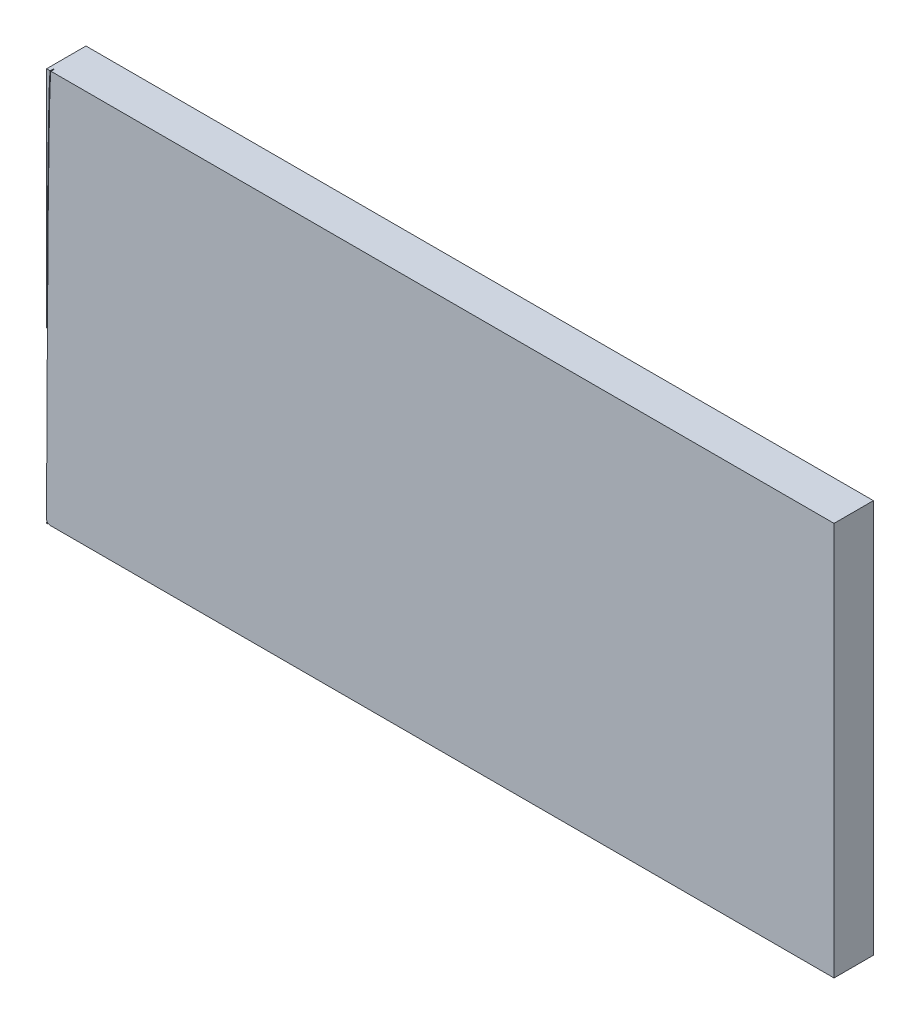
ISO-10303-21;
HEADER;
FILE_DESCRIPTION(('STEP AP214'),'2;1');
FILE_NAME('part.step','',(''),(''),'','','');
FILE_SCHEMA(('AUTOMOTIVE_DESIGN { 1 0 10303 214 1 1 1 1 }'));
ENDSEC;
DATA;
#1=APPLICATION_CONTEXT('core data for automotive mechanical design processes');
#2=APPLICATION_PROTOCOL_DEFINITION('international standard','automotive_design',2000,#1);
#3=PRODUCT_CONTEXT('',#1,'mechanical');
#4=PRODUCT('Part','Part','',(#3));
#5=PRODUCT_RELATED_PRODUCT_CATEGORY('part','',(#4));
#6=PRODUCT_DEFINITION_FORMATION('','',#4);
#7=PRODUCT_DEFINITION_CONTEXT('part definition',#1,'design');
#8=PRODUCT_DEFINITION('design','',#6,#7);
#9=PRODUCT_DEFINITION_SHAPE('','',#8);
#10=(LENGTH_UNIT() NAMED_UNIT(*) SI_UNIT(.MILLI.,.METRE.));
#11=(NAMED_UNIT(*) PLANE_ANGLE_UNIT() SI_UNIT($,.RADIAN.));
#12=(NAMED_UNIT(*) SI_UNIT($,.STERADIAN.) SOLID_ANGLE_UNIT());
#13=UNCERTAINTY_MEASURE_WITH_UNIT(LENGTH_MEASURE(1.E-05),#10,'distance_accuracy_value','');
#14=(GEOMETRIC_REPRESENTATION_CONTEXT(3) GLOBAL_UNCERTAINTY_ASSIGNED_CONTEXT((#13)) GLOBAL_UNIT_ASSIGNED_CONTEXT((#10,
#11,#12)) REPRESENTATION_CONTEXT('',''));
#15=CARTESIAN_POINT('',(0.,0.,0.));
#16=DIRECTION('',(0.,0.,1.));
#17=DIRECTION('',(1.,0.,0.));
#18=AXIS2_PLACEMENT_3D('',#15,#16,#17);
#19=CARTESIAN_POINT('',(0.,0.,127.));
#20=DIRECTION('',(0.,0.,-1.));
#21=DIRECTION('',(-1.,0.,0.));
#22=AXIS2_PLACEMENT_3D('',#19,#20,#21);
#23=PLANE('',#22);
#24=CARTESIAN_POINT('',(-42.3012850712292,1243.87428571429,127.));
#25=CARTESIAN_POINT('',(-52.1155044659749,1243.73864680293,127.));
#26=CARTESIAN_POINT('',(-56.7848594057362,34.9749192073273,127.));
#27=CARTESIAN_POINT('',(-56.6057142857144,22.6324198520287,127.));
#28=B_SPLINE_CURVE_WITH_KNOTS('',3,(#24,#25,#26,#27),.UNSPECIFIED.,.F.,.F.,(4,4),(0.,1.),.UNSPECIFIED.);
#29=CARTESIAN_POINT('',(-42.3012850712292,1243.87428571429,127.));
#30=VERTEX_POINT('',#29);
#31=CARTESIAN_POINT('',(-56.6057142857143,28.7711471672931,127.));
#32=VERTEX_POINT('',#31);
#33=EDGE_CURVE('E135',#30,#32,#28,.T.);
#34=ORIENTED_EDGE('',*,*,#33,.T.);
#35=DIRECTION('',(0.,-1.,0.));
#36=VECTOR('',#35,1.);
#37=CARTESIAN_POINT('',(-56.6057142857144,1243.87428571429,127.));
#38=LINE('',#37,#36);
#39=CARTESIAN_POINT('',(-56.6057142857144,-12.2982642373145,127.));
#40=VERTEX_POINT('',#39);
#41=EDGE_CURVE('E203',#32,#40,#38,.T.);
#42=ORIENTED_EDGE('',*,*,#41,.T.);
#43=CARTESIAN_POINT('',(-56.6057142857144,-12.2982642373145,127.));
#44=CARTESIAN_POINT('',(-56.5727621871857,-21.1376170869562,127.));
#45=CARTESIAN_POINT('',(-53.0456704938453,-25.9866982400848,127.));
#46=CARTESIAN_POINT('',(-42.3012850712292,-26.1257142857143,127.));
#47=B_SPLINE_CURVE_WITH_KNOTS('',3,(#43,#44,#45,#46),.UNSPECIFIED.,.F.,.F.,(4,4),(0.,1.),.UNSPECIFIED.);
#48=CARTESIAN_POINT('',(-42.3012850712292,-26.1257142857143,127.));
#49=VERTEX_POINT('',#48);
#50=EDGE_CURVE('E264',#40,#49,#47,.T.);
#51=ORIENTED_EDGE('',*,*,#50,.T.);
#52=DIRECTION('',(1.,0.,0.));
#53=VECTOR('',#52,1.);
#54=CARTESIAN_POINT('',(-56.6057142857143,-26.1257142857143,127.));
#55=LINE('',#54,#53);
#56=CARTESIAN_POINT('',(2483.39428571429,-26.1257142857143,127.));
#57=VERTEX_POINT('',#56);
#58=EDGE_CURVE('E220',#49,#57,#55,.T.);
#59=ORIENTED_EDGE('',*,*,#58,.T.);
#60=DIRECTION('',(0.,-1.,0.));
#61=VECTOR('',#60,1.);
#62=CARTESIAN_POINT('',(2483.39428571429,1243.87428571429,127.));
#63=LINE('',#62,#61);
#64=CARTESIAN_POINT('',(2483.39428571429,1243.87428571429,127.));
#65=VERTEX_POINT('',#64);
#66=EDGE_CURVE('E205',#65,#57,#63,.T.);
#67=ORIENTED_EDGE('',*,*,#66,.F.);
#68=DIRECTION('',(1.,0.,0.));
#69=VECTOR('',#68,1.);
#70=CARTESIAN_POINT('',(-56.6057142857144,1243.87428571429,127.));
#71=LINE('',#70,#69);
#72=EDGE_CURVE('E199',#30,#65,#71,.T.);
#73=ORIENTED_EDGE('',*,*,#72,.F.);
#74=EDGE_LOOP('',(#34,#42,#51,#59,#67,#73));
#75=FACE_BOUND('',#74,.T.);
#76=ADVANCED_FACE('F39',(#75),#23,.F.);
#77=CARTESIAN_POINT('',(-56.6057142857144,1243.87428571429,127.));
#78=VERTEX_POINT('',#77);
#79=CARTESIAN_POINT('',(-56.6057142858211,519.524275061396,127.));
#80=VERTEX_POINT('',#79);
#81=EDGE_CURVE('E191',#78,#80,#38,.T.);
#82=ORIENTED_EDGE('',*,*,#81,.T.);
#83=CARTESIAN_POINT('',(-42.3363861752485,1246.41404316579,127.));
#84=CARTESIAN_POINT('',(-42.5495716758496,1246.41109680317,127.));
#85=CARTESIAN_POINT('',(-42.7612244182873,1246.38163542832,127.));
#86=CARTESIAN_POINT('',(-43.1511692690802,1246.28244276995,127.));
#87=CARTESIAN_POINT('',(-43.3292561058576,1246.21341021825,127.));
#88=CARTESIAN_POINT('',(-43.641664424916,1246.05878160045,127.));
#89=CARTESIAN_POINT('',(-43.7763924169793,1245.9734834972,127.));
#90=CARTESIAN_POINT('',(-44.0084851603743,1245.80276473524,127.));
#91=CARTESIAN_POINT('',(-44.1061481374805,1245.7172621697,127.));
#92=CARTESIAN_POINT('',(-44.3587428844354,1245.47068072945,127.));
#93=CARTESIAN_POINT('',(-44.4748627545593,1245.32021273476,127.));
#94=CARTESIAN_POINT('',(-44.6605648666339,1245.0495459359,127.));
#95=CARTESIAN_POINT('',(-44.7295500162383,1244.92818696503,127.));
#96=CARTESIAN_POINT('',(-44.9043623013462,1244.5892308458,127.));
#97=CARTESIAN_POINT('',(-44.9795671924874,1244.39465095095,127.));
#98=CARTESIAN_POINT('',(-45.111700992093,1244.0111778793,127.));
#99=CARTESIAN_POINT('',(-45.1660897062559,1243.82331283963,127.));
#100=CARTESIAN_POINT('',(-45.3176692194605,1243.23734399333,127.));
#101=CARTESIAN_POINT('',(-45.4030426685015,1242.81584899436,127.));
#102=CARTESIAN_POINT('',(-45.5686949333253,1241.85602983432,127.));
#103=CARTESIAN_POINT('',(-45.6476587854724,1241.31976230487,127.));
#104=CARTESIAN_POINT('',(-45.8805299854355,1239.5210006222,127.));
#105=CARTESIAN_POINT('',(-46.0302217724448,1238.06836089664,127.));
#106=CARTESIAN_POINT('',(-46.3260253874934,1234.64012832316,127.));
#107=CARTESIAN_POINT('',(-46.4717375418899,1232.66591596795,127.));
#108=CARTESIAN_POINT('',(-46.9043342671375,1225.97720903699,127.));
#109=CARTESIAN_POINT('',(-47.1866179394066,1220.49661803958,127.));
#110=CARTESIAN_POINT('',(-47.7409264891347,1207.62131086472,127.));
#111=CARTESIAN_POINT('',(-48.0128461971767,1200.22733806259,127.));
#112=CARTESIAN_POINT('',(-49.3471760321734,1158.83150693979,127.));
#113=CARTESIAN_POINT('',(-50.3339448511548,1111.54793679969,127.));
#114=CARTESIAN_POINT('',(-53.0568913673371,941.226989355821,127.));
#115=CARTESIAN_POINT('',(-54.5550449936448,789.729621862863,127.));
#116=CARTESIAN_POINT('',(-56.9268229007956,485.971893095493,127.));
#117=CARTESIAN_POINT('',(-57.8004020015175,333.713089740301,127.));
#118=CARTESIAN_POINT('',(-58.6492759233292,161.121262599132,127.));
#119=CARTESIAN_POINT('',(-58.8553175075413,112.890130191541,127.));
#120=CARTESIAN_POINT('',(-59.0498760445666,61.5379801509372,127.));
#121=CARTESIAN_POINT('',(-59.0956448220798,47.9197759443375,127.));
#122=CARTESIAN_POINT('',(-59.1357825002151,33.6208510738069,127.));
#123=CARTESIAN_POINT('',(-59.144409355143,29.876068043908,127.));
#124=CARTESIAN_POINT('',(-59.1502344942744,25.8994568556923,127.));
#125=CARTESIAN_POINT('',(-59.1509912774685,24.8474905510731,127.));
#126=CARTESIAN_POINT('',(-59.1503429150153,23.6912458534018,127.));
#127=CARTESIAN_POINT('',(-59.149831021123,23.3762134547188,127.));
#128=CARTESIAN_POINT('',(-59.1486007637388,23.0085760561042,127.));
#129=CARTESIAN_POINT('',(-59.14811452718,22.903540891139,127.));
#130=CARTESIAN_POINT('',(-59.1469607259598,22.7266841978005,127.));
#131=CARTESIAN_POINT('',(-59.1463193008106,22.6556709324713,127.));
#132=CARTESIAN_POINT('',(-59.1454467764384,22.5955569226676,127.));
#133=B_SPLINE_CURVE_WITH_KNOTS('',3,(#83,#84,#85,#86,#87,#88,#89,#90,#91,#92,#93,#94,#95,#96,
#97,#98,#99,#100,#101,#102,#103,#104,#105,#106,#107,#108,#109,#110,#111,#112,#113,#114,#115,
#116,#117,#118,#119,#120,#121,#122,#123,#124,#125,#126,#127,#128,#129,#130,#131,#132),
.UNSPECIFIED.,.F.,.F.,(4,2,2,2,2,2,2,2,2,2,2,2,2,2,2,2,2,2,2,2,2,2,2,2,4),(0.,
0.000976562499999343,0.00195312499999869,0.00292968749999803,0.00390624999999737,
0.00585937499999735,0.00781249999999732,0.0117187499999973,0.0156249999999973,
0.0234374999999973,0.0312499999999974,0.0468749999999974,0.0624999999999974,0.0937499999999975,
0.124999999999998,0.249999999999998,0.499999999999998,0.749999999999999,0.875,0.9375,0.96875,
0.984375,0.9921875,0.99609375,1.),.UNSPECIFIED.);
#134=CARTESIAN_POINT('',(-45.1493775916594,1243.87428572405,127.));
#135=VERTEX_POINT('',#134);
#136=EDGE_CURVE('E184',#80,#135,#133,.F.);
#137=ORIENTED_EDGE('',*,*,#136,.T.);
#138=EDGE_CURVE('E189',#78,#135,#71,.T.);
#139=ORIENTED_EDGE('',*,*,#138,.F.);
#140=EDGE_LOOP('',(#82,#137,#139));
#141=FACE_BOUND('',#140,.T.);
#142=ADVANCED_FACE('F188',(#141),#23,.F.);
#143=CARTESIAN_POINT('',(-56.6057142857143,-26.1257142857143,127.));
#144=DIRECTION('',(0.,1.,0.));
#145=DIRECTION('',(0.,0.,1.));
#146=AXIS2_PLACEMENT_3D('',#143,#144,#145);
#147=PLANE('',#146);
#148=DIRECTION('',(-1.,0.,0.));
#149=VECTOR('',#148,1.);
#150=CARTESIAN_POINT('',(-56.6057142857143,-26.1257142857143,116.84));
#151=LINE('',#150,#149);
#152=CARTESIAN_POINT('',(-42.3012850712292,-26.1257142857143,116.84));
#153=VERTEX_POINT('',#152);
#154=CARTESIAN_POINT('',(-52.96506687173,-26.1257142954648,116.84));
#155=VERTEX_POINT('',#154);
#156=EDGE_CURVE('E156',#153,#155,#151,.T.);
#157=ORIENTED_EDGE('',*,*,#156,.T.);
#158=DIRECTION('',(0.,0.,1.));
#159=VECTOR('',#158,1.);
#160=CARTESIAN_POINT('',(-52.9650668873842,-26.1257142857143,116.84));
#161=LINE('',#160,#159);
#162=CARTESIAN_POINT('',(-52.96506687173,-26.1257142954648,127.));
#163=VERTEX_POINT('',#162);
#164=EDGE_CURVE('E171',#155,#163,#161,.T.);
#165=ORIENTED_EDGE('',*,*,#164,.T.);
#166=CARTESIAN_POINT('',(-56.6057142857143,-26.1257142857143,127.));
#167=VERTEX_POINT('',#166);
#168=EDGE_CURVE('E416',#167,#163,#55,.T.);
#169=ORIENTED_EDGE('',*,*,#168,.F.);
#170=DIRECTION('',(0.,0.,-1.));
#171=VECTOR('',#170,1.);
#172=CARTESIAN_POINT('',(-56.6057142857143,-26.1257142857143,127.));
#173=LINE('',#172,#171);
#174=CARTESIAN_POINT('',(-56.6057142857143,-26.1257142857143,0.));
#175=VERTEX_POINT('',#174);
#176=EDGE_CURVE('E208',#167,#175,#173,.T.);
#177=ORIENTED_EDGE('',*,*,#176,.T.);
#178=DIRECTION('',(1.,0.,0.));
#179=VECTOR('',#178,1.);
#180=CARTESIAN_POINT('',(-56.6057142857143,-26.1257142857143,0.));
#181=LINE('',#180,#179);
#182=CARTESIAN_POINT('',(2483.39428571429,-26.1257142857143,0.));
#183=VERTEX_POINT('',#182);
#184=EDGE_CURVE('E155',#175,#183,#181,.T.);
#185=ORIENTED_EDGE('',*,*,#184,.T.);
#186=DIRECTION('',(0.,0.,-1.));
#187=VECTOR('',#186,1.);
#188=CARTESIAN_POINT('',(2483.39428571429,-26.1257142857143,127.));
#189=LINE('',#188,#187);
#190=EDGE_CURVE('E229',#57,#183,#189,.T.);
#191=ORIENTED_EDGE('',*,*,#190,.F.);
#192=ORIENTED_EDGE('',*,*,#58,.F.);
#193=DIRECTION('',(0.,0.,1.));
#194=VECTOR('',#193,1.);
#195=CARTESIAN_POINT('',(-42.3012850712292,-26.1257142857143,116.84));
#196=LINE('',#195,#194);
#197=EDGE_CURVE('E64',#153,#49,#196,.T.);
#198=ORIENTED_EDGE('',*,*,#197,.F.);
#199=EDGE_LOOP('',(#157,#165,#169,#177,#185,#191,#192,#198));
#200=FACE_BOUND('',#199,.T.);
#201=ADVANCED_FACE('F41',(#200),#147,.F.);
#202=CARTESIAN_POINT('',(2483.39428571429,1243.87428571429,127.));
#203=DIRECTION('',(1.,0.,0.));
#204=DIRECTION('',(0.,1.,0.));
#205=AXIS2_PLACEMENT_3D('',#202,#203,#204);
#206=PLANE('',#205);
#207=DIRECTION('',(0.,-1.,0.));
#208=VECTOR('',#207,1.);
#209=CARTESIAN_POINT('',(2483.39428571429,1243.87428571429,0.));
#210=LINE('',#209,#208);
#211=CARTESIAN_POINT('',(2483.39428571429,1243.87428571429,0.));
#212=VERTEX_POINT('',#211);
#213=EDGE_CURVE('E161',#212,#183,#210,.T.);
#214=ORIENTED_EDGE('',*,*,#213,.F.);
#215=DIRECTION('',(0.,0.,-1.));
#216=VECTOR('',#215,1.);
#217=CARTESIAN_POINT('',(2483.39428571429,1243.87428571429,127.));
#218=LINE('',#217,#216);
#219=EDGE_CURVE('E226',#65,#212,#218,.T.);
#220=ORIENTED_EDGE('',*,*,#219,.F.);
#221=ORIENTED_EDGE('',*,*,#66,.T.);
#222=ORIENTED_EDGE('',*,*,#190,.T.);
#223=EDGE_LOOP('',(#214,#220,#221,#222));
#224=FACE_BOUND('',#223,.T.);
#225=ADVANCED_FACE('F297',(#224),#206,.T.);
#226=CARTESIAN_POINT('',(-56.6057142857144,1243.87428571429,127.));
#227=DIRECTION('',(0.,1.,0.));
#228=DIRECTION('',(0.,0.,1.));
#229=AXIS2_PLACEMENT_3D('',#226,#227,#228);
#230=PLANE('',#229);
#231=DIRECTION('',(0.,0.,1.));
#232=VECTOR('',#231,1.);
#233=CARTESIAN_POINT('',(-45.1493775944815,1243.87428571429,116.84));
#234=LINE('',#233,#232);
#235=CARTESIAN_POINT('',(-45.1493775916595,1243.87428572405,116.84));
#236=VERTEX_POINT('',#235);
#237=EDGE_CURVE('E153',#236,#135,#234,.T.);
#238=ORIENTED_EDGE('',*,*,#237,.F.);
#239=DIRECTION('',(-1.,0.,0.));
#240=VECTOR('',#239,1.);
#241=CARTESIAN_POINT('',(-56.6057142857144,1243.87428571429,116.84));
#242=LINE('',#241,#240);
#243=CARTESIAN_POINT('',(-42.3012850712292,1243.87428571429,116.84));
#244=VERTEX_POINT('',#243);
#245=EDGE_CURVE('E145',#244,#236,#242,.T.);
#246=ORIENTED_EDGE('',*,*,#245,.F.);
#247=DIRECTION('',(0.,0.,1.));
#248=VECTOR('',#247,1.);
#249=CARTESIAN_POINT('',(-42.3012850712292,1243.87428571429,116.84));
#250=LINE('',#249,#248);
#251=EDGE_CURVE('E131',#244,#30,#250,.T.);
#252=ORIENTED_EDGE('',*,*,#251,.T.);
#253=ORIENTED_EDGE('',*,*,#72,.T.);
#254=ORIENTED_EDGE('',*,*,#219,.T.);
#255=DIRECTION('',(1.,0.,0.));
#256=VECTOR('',#255,1.);
#257=CARTESIAN_POINT('',(-56.6057142857144,1243.87428571429,0.));
#258=LINE('',#257,#256);
#259=CARTESIAN_POINT('',(-56.6057142857144,1243.87428571429,0.));
#260=VERTEX_POINT('',#259);
#261=EDGE_CURVE('E213',#260,#212,#258,.T.);
#262=ORIENTED_EDGE('',*,*,#261,.F.);
#263=DIRECTION('',(0.,0.,-1.));
#264=VECTOR('',#263,1.);
#265=CARTESIAN_POINT('',(-56.6057142857144,1243.87428571429,127.));
#266=LINE('',#265,#264);
#267=EDGE_CURVE('E196',#78,#260,#266,.T.);
#268=ORIENTED_EDGE('',*,*,#267,.F.);
#269=ORIENTED_EDGE('',*,*,#138,.T.);
#270=EDGE_LOOP('',(#238,#246,#252,#253,#254,#262,#268,#269));
#271=FACE_BOUND('',#270,.T.);
#272=ADVANCED_FACE('F151',(#271),#230,.T.);
#273=CARTESIAN_POINT('',(-56.6057142857144,1243.87428571429,127.));
#274=DIRECTION('',(1.,0.,0.));
#275=DIRECTION('',(0.,1.,0.));
#276=AXIS2_PLACEMENT_3D('',#273,#274,#275);
#277=PLANE('',#276);
#278=DIRECTION('',(0.,0.,1.));
#279=VECTOR('',#278,1.);
#280=CARTESIAN_POINT('',(-56.6057142857143,28.7711482864971,116.84));
#281=LINE('',#280,#279);
#282=CARTESIAN_POINT('',(-56.6057142877742,28.771147167293,116.84));
#283=VERTEX_POINT('',#282);
#284=EDGE_CURVE('E56',#283,#32,#281,.T.);
#285=ORIENTED_EDGE('',*,*,#284,.F.);
#286=DIRECTION('',(0.,1.,0.));
#287=VECTOR('',#286,1.);
#288=CARTESIAN_POINT('',(-56.6057142857144,1243.87428571429,116.84));
#289=LINE('',#288,#287);
#290=CARTESIAN_POINT('',(-56.6057142858211,519.524275061395,116.84));
#291=VERTEX_POINT('',#290);
#292=EDGE_CURVE('E11',#283,#291,#289,.T.);
#293=ORIENTED_EDGE('',*,*,#292,.T.);
#294=DIRECTION('',(0.,0.,1.));
#295=VECTOR('',#294,1.);
#296=CARTESIAN_POINT('',(-56.6057142857144,519.524275076988,116.84));
#297=LINE('',#296,#295);
#298=EDGE_CURVE('E170',#291,#80,#297,.T.);
#299=ORIENTED_EDGE('',*,*,#298,.T.);
#300=ORIENTED_EDGE('',*,*,#81,.F.);
#301=ORIENTED_EDGE('',*,*,#267,.T.);
#302=DIRECTION('',(0.,-1.,0.));
#303=VECTOR('',#302,1.);
#304=CARTESIAN_POINT('',(-56.6057142857144,1243.87428571429,0.));
#305=LINE('',#304,#303);
#306=EDGE_CURVE('E217',#260,#175,#305,.T.);
#307=ORIENTED_EDGE('',*,*,#306,.T.);
#308=ORIENTED_EDGE('',*,*,#176,.F.);
#309=CARTESIAN_POINT('',(-56.6057142853474,-22.6001355552564,127.));
#310=VERTEX_POINT('',#309);
#311=EDGE_CURVE('E198',#310,#167,#38,.T.);
#312=ORIENTED_EDGE('',*,*,#311,.F.);
#313=DIRECTION('',(0.,0.,1.));
#314=VECTOR('',#313,1.);
#315=CARTESIAN_POINT('',(-56.6057142857143,-22.6001355547031,116.84));
#316=LINE('',#315,#314);
#317=CARTESIAN_POINT('',(-56.6057142853476,-22.6001355552561,116.84));
#318=VERTEX_POINT('',#317);
#319=EDGE_CURVE('E140',#310,#318,#316,.F.);
#320=ORIENTED_EDGE('',*,*,#319,.T.);
#321=DIRECTION('',(0.,1.,0.));
#322=VECTOR('',#321,1.);
#323=CARTESIAN_POINT('',(-56.6057142857144,1243.87428571429,116.84));
#324=LINE('',#323,#322);
#325=CARTESIAN_POINT('',(-56.6057142857144,-12.2982642373145,116.84));
#326=VERTEX_POINT('',#325);
#327=EDGE_CURVE('E49',#318,#326,#324,.T.);
#328=ORIENTED_EDGE('',*,*,#327,.T.);
#329=DIRECTION('',(0.,0.,1.));
#330=VECTOR('',#329,1.);
#331=CARTESIAN_POINT('',(-56.6057142857144,-12.2982642373145,116.84));
#332=LINE('',#331,#330);
#333=EDGE_CURVE('E251',#326,#40,#332,.T.);
#334=ORIENTED_EDGE('',*,*,#333,.T.);
#335=ORIENTED_EDGE('',*,*,#41,.F.);
#336=EDGE_LOOP('',(#285,#293,#299,#300,#301,#307,#308,#312,#320,#328,#334,#335));
#337=FACE_BOUND('',#336,.T.);
#338=ADVANCED_FACE('F249',(#337),#277,.F.);
#339=ORIENTED_EDGE('',*,*,#168,.T.);
#340=CARTESIAN_POINT('',(-59.1456966365395,-12.3077330016131,127.));
#341=CARTESIAN_POINT('',(-59.1412643888771,-13.4966770371578,127.));
#342=CARTESIAN_POINT('',(-59.078350174367,-14.6383924896005,127.));
#343=CARTESIAN_POINT('',(-58.8081305972035,-16.831871953723,127.));
#344=CARTESIAN_POINT('',(-58.600773645721,-17.8840964026772,127.));
#345=CARTESIAN_POINT('',(-58.0056345643777,-19.8945545865563,127.));
#346=CARTESIAN_POINT('',(-57.6170703927993,-20.8532587445806,127.));
#347=CARTESIAN_POINT('',(-56.6249243139079,-22.647429062385,127.));
#348=CARTESIAN_POINT('',(-56.0203799066609,-23.4818771971626,127.));
#349=CARTESIAN_POINT('',(-54.5944551195147,-24.9753745222552,127.));
#350=CARTESIAN_POINT('',(-53.7743040740128,-25.6329118321916,127.));
#351=CARTESIAN_POINT('',(-51.9510290542225,-26.7447371174721,127.));
#352=CARTESIAN_POINT('',(-50.9491904219624,-27.1997693905845,127.));
#353=CARTESIAN_POINT('',(-48.7820867373454,-27.9200539186786,127.));
#354=CARTESIAN_POINT('',(-47.6164741331835,-28.1862152317287,127.));
#355=CARTESIAN_POINT('',(-45.1115800515105,-28.5495755559969,127.));
#356=CARTESIAN_POINT('',(-43.7717993894365,-28.6469006561601,127.));
#357=CARTESIAN_POINT('',(-42.3341460670352,-28.6655017088965,127.));
#358=B_SPLINE_CURVE_WITH_KNOTS('',3,(#340,#341,#342,#343,#344,#345,#346,#347,#348,#349,#350,
#351,#352,#353,#354,#355,#356,#357),.UNSPECIFIED.,.F.,.F.,(4,2,2,2,2,2,2,2,4),(0.,0.125,0.25,
0.375,0.5,0.625,0.75,0.875,1.),.UNSPECIFIED.);
#359=EDGE_CURVE('E193',#163,#310,#358,.F.);
#360=ORIENTED_EDGE('',*,*,#359,.T.);
#361=ORIENTED_EDGE('',*,*,#311,.T.);
#362=EDGE_LOOP('',(#339,#360,#361));
#363=FACE_BOUND('',#362,.T.);
#364=ADVANCED_FACE('F286',(#363),#23,.F.);
#365=CARTESIAN_POINT('',(0.,0.,0.));
#366=DIRECTION('',(0.,0.,-1.));
#367=DIRECTION('',(-1.,0.,0.));
#368=AXIS2_PLACEMENT_3D('',#365,#366,#367);
#369=PLANE('',#368);
#370=ORIENTED_EDGE('',*,*,#184,.F.);
#371=ORIENTED_EDGE('',*,*,#306,.F.);
#372=ORIENTED_EDGE('',*,*,#261,.T.);
#373=ORIENTED_EDGE('',*,*,#213,.T.);
#374=EDGE_LOOP('',(#370,#371,#372,#373));
#375=FACE_BOUND('',#374,.T.);
#376=ADVANCED_FACE('F289',(#375),#369,.T.);
#377=CARTESIAN_POINT('',(-55.3074175130878,-24.2286258597089,116.84));
#378=DIRECTION('',(0.,0.,-1.));
#379=DIRECTION('',(-1.,0.,0.));
#380=AXIS2_PLACEMENT_3D('',#377,#378,#379);
#381=PLANE('',#380);
#382=CARTESIAN_POINT('',(-56.6057142857144,-12.2982642373145,116.84));
#383=CARTESIAN_POINT('',(-56.5727621871857,-21.1376170869562,116.84));
#384=CARTESIAN_POINT('',(-53.0456704938453,-25.9866982400848,116.84));
#385=CARTESIAN_POINT('',(-42.3012850712292,-26.1257142857143,116.84));
#386=B_SPLINE_CURVE_WITH_KNOTS('',3,(#382,#383,#384,#385),.UNSPECIFIED.,.F.,.F.,(4,4),(0.,1.),.UNSPECIFIED.);
#387=EDGE_CURVE('E259',#326,#153,#386,.T.);
#388=ORIENTED_EDGE('',*,*,#387,.F.);
#389=ORIENTED_EDGE('',*,*,#327,.F.);
#390=CARTESIAN_POINT('',(-59.1456966365395,-12.3077330016131,116.84));
#391=CARTESIAN_POINT('',(-59.1412643888771,-13.4966770371578,116.84));
#392=CARTESIAN_POINT('',(-59.078350174367,-14.6383924896005,116.84));
#393=CARTESIAN_POINT('',(-58.8081305972035,-16.831871953723,116.84));
#394=CARTESIAN_POINT('',(-58.600773645721,-17.8840964026772,116.84));
#395=CARTESIAN_POINT('',(-58.0056345643777,-19.8945545865563,116.84));
#396=CARTESIAN_POINT('',(-57.6170703927993,-20.8532587445806,116.84));
#397=CARTESIAN_POINT('',(-56.6249243139079,-22.647429062385,116.84));
#398=CARTESIAN_POINT('',(-56.0203799066609,-23.4818771971626,116.84));
#399=CARTESIAN_POINT('',(-54.5944551195147,-24.9753745222552,116.84));
#400=CARTESIAN_POINT('',(-53.7743040740128,-25.6329118321916,116.84));
#401=CARTESIAN_POINT('',(-51.9510290542225,-26.7447371174721,116.84));
#402=CARTESIAN_POINT('',(-50.9491904219624,-27.1997693905845,116.84));
#403=CARTESIAN_POINT('',(-48.7820867373454,-27.9200539186786,116.84));
#404=CARTESIAN_POINT('',(-47.6164741331835,-28.1862152317287,116.84));
#405=CARTESIAN_POINT('',(-45.1115800515105,-28.5495755559969,116.84));
#406=CARTESIAN_POINT('',(-43.7717993894365,-28.6469006561601,116.84));
#407=CARTESIAN_POINT('',(-42.3341460670352,-28.6655017088965,116.84));
#408=B_SPLINE_CURVE_WITH_KNOTS('',3,(#390,#391,#392,#393,#394,#395,#396,#397,#398,#399,#400,
#401,#402,#403,#404,#405,#406,#407),.UNSPECIFIED.,.F.,.F.,(4,2,2,2,2,2,2,2,4),(0.,0.125,0.25,
0.375,0.5,0.625,0.75,0.875,1.),.UNSPECIFIED.);
#409=EDGE_CURVE('E258',#318,#155,#408,.T.);
#410=ORIENTED_EDGE('',*,*,#409,.T.);
#411=ORIENTED_EDGE('',*,*,#156,.F.);
#412=EDGE_LOOP('',(#388,#389,#410,#411));
#413=FACE_BOUND('',#412,.T.);
#414=ADVANCED_FACE('F257',(#413),#381,.F.);
#415=DIRECTION('',(0.,0.,1.));
#416=VECTOR('',#415,1.);
#417=SURFACE_OF_LINEAR_EXTRUSION('',#408,#416);
#418=ORIENTED_EDGE('',*,*,#409,.F.);
#419=ORIENTED_EDGE('',*,*,#319,.F.);
#420=ORIENTED_EDGE('',*,*,#359,.F.);
#421=ORIENTED_EDGE('',*,*,#164,.F.);
#422=EDGE_LOOP('',(#418,#419,#420,#421));
#423=FACE_BOUND('',#422,.T.);
#424=ADVANCED_FACE('F261',(#423),#417,.F.);
#425=DIRECTION('',(0.,0.,1.));
#426=VECTOR('',#425,1.);
#427=SURFACE_OF_LINEAR_EXTRUSION('',#386,#426);
#428=ORIENTED_EDGE('',*,*,#50,.F.);
#429=ORIENTED_EDGE('',*,*,#333,.F.);
#430=ORIENTED_EDGE('',*,*,#387,.T.);
#431=ORIENTED_EDGE('',*,*,#197,.T.);
#432=EDGE_LOOP('',(#428,#429,#430,#431));
#433=FACE_BOUND('',#432,.T.);
#434=ADVANCED_FACE('F284',(#433),#427,.T.);
#435=CARTESIAN_POINT('',(-55.7409339472202,637.850757479175,116.84));
#436=DIRECTION('',(0.,0.,-1.));
#437=DIRECTION('',(-1.,0.,0.));
#438=AXIS2_PLACEMENT_3D('',#435,#436,#437);
#439=PLANE('',#438);
#440=ORIENTED_EDGE('',*,*,#245,.T.);
#441=CARTESIAN_POINT('',(-42.3363861752485,1246.41404316579,116.84));
#442=CARTESIAN_POINT('',(-42.5495716758496,1246.41109680317,116.84));
#443=CARTESIAN_POINT('',(-42.7612244182873,1246.38163542832,116.84));
#444=CARTESIAN_POINT('',(-43.1511692690802,1246.28244276995,116.84));
#445=CARTESIAN_POINT('',(-43.3292561058576,1246.21341021825,116.84));
#446=CARTESIAN_POINT('',(-43.641664424916,1246.05878160045,116.84));
#447=CARTESIAN_POINT('',(-43.7763924169793,1245.9734834972,116.84));
#448=CARTESIAN_POINT('',(-44.0084851603743,1245.80276473524,116.84));
#449=CARTESIAN_POINT('',(-44.1061481374805,1245.7172621697,116.84));
#450=CARTESIAN_POINT('',(-44.3587428844354,1245.47068072945,116.84));
#451=CARTESIAN_POINT('',(-44.4748627545593,1245.32021273476,116.84));
#452=CARTESIAN_POINT('',(-44.6605648666339,1245.0495459359,116.84));
#453=CARTESIAN_POINT('',(-44.7295500162383,1244.92818696503,116.84));
#454=CARTESIAN_POINT('',(-44.9043623013462,1244.5892308458,116.84));
#455=CARTESIAN_POINT('',(-44.9795671924874,1244.39465095095,116.84));
#456=CARTESIAN_POINT('',(-45.111700992093,1244.0111778793,116.84));
#457=CARTESIAN_POINT('',(-45.1660897062559,1243.82331283963,116.84));
#458=CARTESIAN_POINT('',(-45.3176692194605,1243.23734399333,116.84));
#459=CARTESIAN_POINT('',(-45.4030426685015,1242.81584899436,116.84));
#460=CARTESIAN_POINT('',(-45.5686949333253,1241.85602983432,116.84));
#461=CARTESIAN_POINT('',(-45.6476587854724,1241.31976230487,116.84));
#462=CARTESIAN_POINT('',(-45.8805299854355,1239.5210006222,116.84));
#463=CARTESIAN_POINT('',(-46.0302217724448,1238.06836089664,116.84));
#464=CARTESIAN_POINT('',(-46.3260253874934,1234.64012832316,116.84));
#465=CARTESIAN_POINT('',(-46.4717375418899,1232.66591596795,116.84));
#466=CARTESIAN_POINT('',(-46.9043342671375,1225.97720903699,116.84));
#467=CARTESIAN_POINT('',(-47.1866179394066,1220.49661803958,116.84));
#468=CARTESIAN_POINT('',(-47.7409264891347,1207.62131086472,116.84));
#469=CARTESIAN_POINT('',(-48.0128461971767,1200.22733806259,116.84));
#470=CARTESIAN_POINT('',(-49.3471760321734,1158.83150693979,116.84));
#471=CARTESIAN_POINT('',(-50.3339448511548,1111.54793679969,116.84));
#472=CARTESIAN_POINT('',(-53.0568913673371,941.226989355821,116.84));
#473=CARTESIAN_POINT('',(-54.5550449936448,789.729621862863,116.84));
#474=CARTESIAN_POINT('',(-56.9268229007956,485.971893095493,116.84));
#475=CARTESIAN_POINT('',(-57.8004020015175,333.713089740301,116.84));
#476=CARTESIAN_POINT('',(-58.6492759233292,161.121262599132,116.84));
#477=CARTESIAN_POINT('',(-58.8553175075413,112.890130191541,116.84));
#478=CARTESIAN_POINT('',(-59.0498760445666,61.5379801509372,116.84));
#479=CARTESIAN_POINT('',(-59.0956448220798,47.9197759443375,116.84));
#480=CARTESIAN_POINT('',(-59.1357825002151,33.6208510738069,116.84));
#481=CARTESIAN_POINT('',(-59.144409355143,29.876068043908,116.84));
#482=CARTESIAN_POINT('',(-59.1502344942744,25.8994568556923,116.84));
#483=CARTESIAN_POINT('',(-59.1509912774685,24.8474905510731,116.84));
#484=CARTESIAN_POINT('',(-59.1503429150153,23.6912458534018,116.84));
#485=CARTESIAN_POINT('',(-59.149831021123,23.3762134547188,116.84));
#486=CARTESIAN_POINT('',(-59.1486007637388,23.0085760561042,116.84));
#487=CARTESIAN_POINT('',(-59.14811452718,22.903540891139,116.84));
#488=CARTESIAN_POINT('',(-59.1469607259598,22.7266841978005,116.84));
#489=CARTESIAN_POINT('',(-59.1463193008106,22.6556709324713,116.84));
#490=CARTESIAN_POINT('',(-59.1454467764384,22.5955569226676,116.84));
#491=B_SPLINE_CURVE_WITH_KNOTS('',3,(#441,#442,#443,#444,#445,#446,#447,#448,#449,#450,#451,
#452,#453,#454,#455,#456,#457,#458,#459,#460,#461,#462,#463,#464,#465,#466,#467,#468,#469,#470,
#471,#472,#473,#474,#475,#476,#477,#478,#479,#480,#481,#482,#483,#484,#485,#486,#487,#488,#489,
#490),.UNSPECIFIED.,.F.,.F.,(4,2,2,2,2,2,2,2,2,2,2,2,2,2,2,2,2,2,2,2,2,2,2,2,4),(0.,
0.000976562499999343,0.00195312499999869,0.00292968749999803,0.00390624999999737,
0.00585937499999735,0.00781249999999732,0.0117187499999973,0.0156249999999973,
0.0234374999999973,0.0312499999999974,0.0468749999999974,0.0624999999999974,0.0937499999999975,
0.124999999999998,0.249999999999998,0.499999999999998,0.749999999999999,0.875,0.9375,0.96875,
0.984375,0.9921875,0.99609375,1.),.UNSPECIFIED.);
#492=EDGE_CURVE('E148',#236,#291,#491,.T.);
#493=ORIENTED_EDGE('',*,*,#492,.T.);
#494=ORIENTED_EDGE('',*,*,#292,.F.);
#495=CARTESIAN_POINT('',(-42.3012850712292,1243.87428571429,116.84));
#496=CARTESIAN_POINT('',(-52.1155044659749,1243.73864680293,116.84));
#497=CARTESIAN_POINT('',(-56.7848594057362,34.9749192073273,116.84));
#498=CARTESIAN_POINT('',(-56.6057142857144,22.6324198520287,116.84));
#499=B_SPLINE_CURVE_WITH_KNOTS('',3,(#495,#496,#497,#498),.UNSPECIFIED.,.F.,.F.,(4,4),(0.,1.),.UNSPECIFIED.);
#500=EDGE_CURVE('E134',#244,#283,#499,.T.);
#501=ORIENTED_EDGE('',*,*,#500,.F.);
#502=EDGE_LOOP('',(#440,#493,#494,#501));
#503=FACE_BOUND('',#502,.T.);
#504=ADVANCED_FACE('F143',(#503),#439,.F.);
#505=DIRECTION('',(0.,0.,1.));
#506=VECTOR('',#505,1.);
#507=SURFACE_OF_LINEAR_EXTRUSION('',#491,#506);
#508=ORIENTED_EDGE('',*,*,#237,.T.);
#509=ORIENTED_EDGE('',*,*,#136,.F.);
#510=ORIENTED_EDGE('',*,*,#298,.F.);
#511=ORIENTED_EDGE('',*,*,#492,.F.);
#512=EDGE_LOOP('',(#508,#509,#510,#511));
#513=FACE_BOUND('',#512,.T.);
#514=ADVANCED_FACE('F183',(#513),#507,.F.);
#515=DIRECTION('',(0.,0.,1.));
#516=VECTOR('',#515,1.);
#517=SURFACE_OF_LINEAR_EXTRUSION('',#499,#516);
#518=ORIENTED_EDGE('',*,*,#284,.T.);
#519=ORIENTED_EDGE('',*,*,#33,.F.);
#520=ORIENTED_EDGE('',*,*,#251,.F.);
#521=ORIENTED_EDGE('',*,*,#500,.T.);
#522=EDGE_LOOP('',(#518,#519,#520,#521));
#523=FACE_BOUND('',#522,.T.);
#524=ADVANCED_FACE('F133',(#523),#517,.T.);
#525=CLOSED_SHELL('',(#76,#142,#201,#225,#272,#338,#364,#376,#414,#424,#434,#504,#514,#524));
#526=MANIFOLD_SOLID_BREP('B2',#525);
#527=ADVANCED_BREP_SHAPE_REPRESENTATION('',(#18,#526),#14);
#528=SHAPE_DEFINITION_REPRESENTATION(#9,#527);
ENDSEC;
END-ISO-10303-21;
